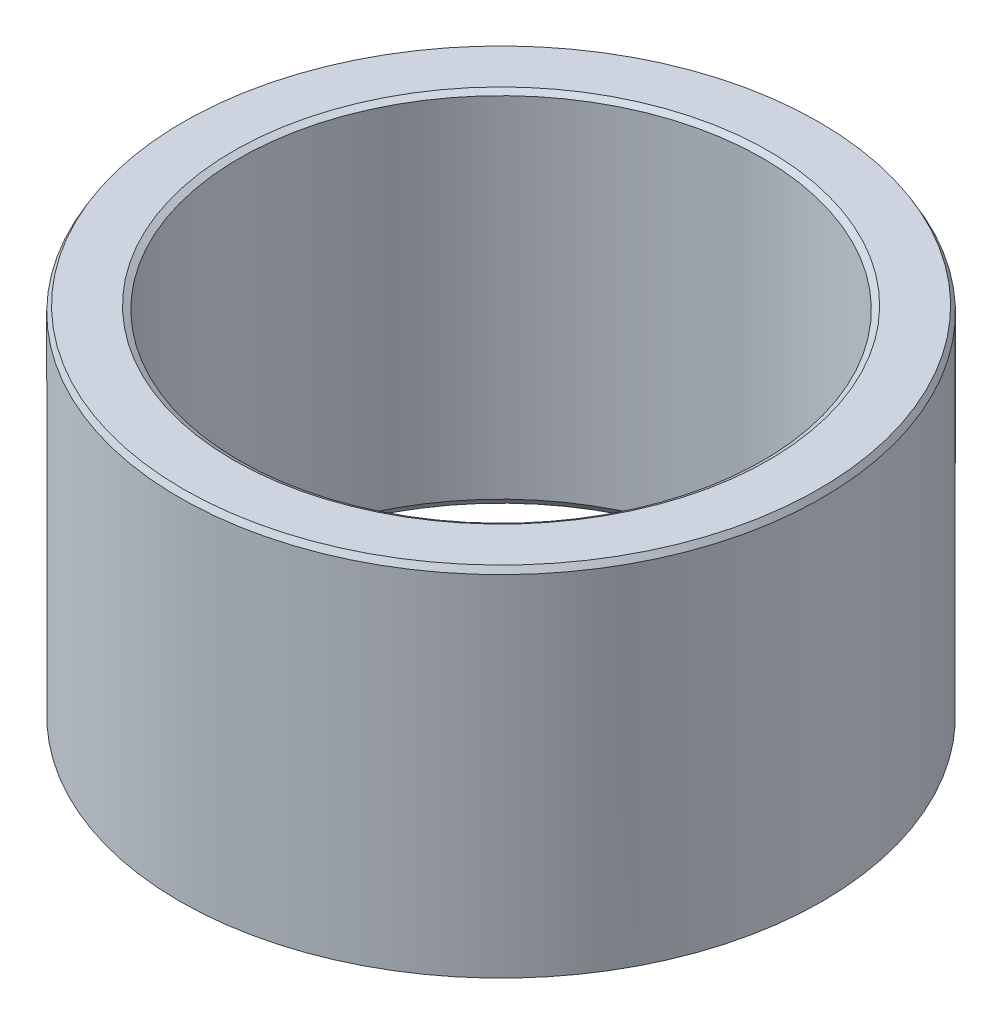
ISO-10303-21;
HEADER;
FILE_DESCRIPTION(('STEP AP214'),'2;1');
FILE_NAME('part.step','',(''),(''),'','','');
FILE_SCHEMA(('AUTOMOTIVE_DESIGN { 1 0 10303 214 1 1 1 1 }'));
ENDSEC;
DATA;
#1=APPLICATION_CONTEXT('core data for automotive mechanical design processes');
#2=APPLICATION_PROTOCOL_DEFINITION('international standard','automotive_design',2000,#1);
#3=PRODUCT_CONTEXT('',#1,'mechanical');
#4=PRODUCT('Part','Part','',(#3));
#5=PRODUCT_RELATED_PRODUCT_CATEGORY('part','',(#4));
#6=PRODUCT_DEFINITION_FORMATION('','',#4);
#7=PRODUCT_DEFINITION_CONTEXT('part definition',#1,'design');
#8=PRODUCT_DEFINITION('design','',#6,#7);
#9=PRODUCT_DEFINITION_SHAPE('','',#8);
#10=(LENGTH_UNIT() NAMED_UNIT(*) SI_UNIT(.MILLI.,.METRE.));
#11=(NAMED_UNIT(*) PLANE_ANGLE_UNIT() SI_UNIT($,.RADIAN.));
#12=(NAMED_UNIT(*) SI_UNIT($,.STERADIAN.) SOLID_ANGLE_UNIT());
#13=UNCERTAINTY_MEASURE_WITH_UNIT(LENGTH_MEASURE(1.E-05),#10,'distance_accuracy_value','');
#14=(GEOMETRIC_REPRESENTATION_CONTEXT(3) GLOBAL_UNCERTAINTY_ASSIGNED_CONTEXT((#13)) GLOBAL_UNIT_ASSIGNED_CONTEXT((#10,
#11,#12)) REPRESENTATION_CONTEXT('',''));
#15=CARTESIAN_POINT('',(0.,0.,0.));
#16=DIRECTION('',(0.,0.,1.));
#17=DIRECTION('',(1.,0.,0.));
#18=AXIS2_PLACEMENT_3D('',#15,#16,#17);
#19=CARTESIAN_POINT('',(0.,58.6155407004771,0.));
#20=DIRECTION('',(0.,-1.,0.));
#21=DIRECTION('',(0.,0.,-1.));
#22=AXIS2_PLACEMENT_3D('',#19,#20,#21);
#23=CYLINDRICAL_SURFACE('',#22,52.5);
#24=CARTESIAN_POINT('',(0.,0.554567945143448,0.));
#25=DIRECTION('',(0.,1.,0.));
#26=DIRECTION('',(0.,0.,1.));
#27=AXIS2_PLACEMENT_3D('',#24,#25,#26);
#28=CIRCLE('',#27,52.5);
#29=CARTESIAN_POINT('',(0.,0.554567945143448,52.5));
#30=VERTEX_POINT('',#29);
#31=EDGE_CURVE('E10',#30,#30,#28,.T.);
#32=ORIENTED_EDGE('',*,*,#31,.T.);
#33=EDGE_LOOP('',(#32));
#34=FACE_BOUND('',#33,.T.);
#35=CARTESIAN_POINT('',(0.,57.6550008432396,0.));
#36=DIRECTION('',(0.,1.,0.));
#37=DIRECTION('',(0.,0.,1.));
#38=AXIS2_PLACEMENT_3D('',#35,#36,#37);
#39=CIRCLE('',#38,52.5);
#40=CARTESIAN_POINT('',(0.,57.6550008432396,-52.5));
#41=VERTEX_POINT('',#40);
#42=EDGE_CURVE('E50',#41,#41,#39,.F.);
#43=ORIENTED_EDGE('',*,*,#42,.T.);
#44=EDGE_LOOP('',(#43));
#45=FACE_BOUND('',#44,.T.);
#46=ADVANCED_FACE('F39',(#34,#45),#23,.T.);
#47=CARTESIAN_POINT('',(0.,58.6155407004771,0.));
#48=DIRECTION('',(0.,1.,0.));
#49=DIRECTION('',(0.,0.,1.));
#50=AXIS2_PLACEMENT_3D('',#47,#48,#49);
#51=PLANE('',#50);
#52=CARTESIAN_POINT('',(0.,58.6155407004771,0.));
#53=DIRECTION('',(0.,1.,0.));
#54=DIRECTION('',(0.,0.,1.));
#55=AXIS2_PLACEMENT_3D('',#52,#53,#54);
#56=CIRCLE('',#55,43.7443498539018);
#57=CARTESIAN_POINT('',(0.,58.6155407004771,43.7443498539018));
#58=VERTEX_POINT('',#57);
#59=EDGE_CURVE('E58',#58,#58,#56,.F.);
#60=ORIENTED_EDGE('',*,*,#59,.T.);
#61=EDGE_LOOP('',(#60));
#62=FACE_BOUND('',#61,.T.);
#63=CARTESIAN_POINT('',(0.,58.6155407004771,0.));
#64=DIRECTION('',(0.,1.,0.));
#65=DIRECTION('',(0.,0.,1.));
#66=AXIS2_PLACEMENT_3D('',#63,#64,#65);
#67=CIRCLE('',#66,51.9454320548565);
#68=CARTESIAN_POINT('',(0.,58.6155407004771,-51.9454320548565));
#69=VERTEX_POINT('',#68);
#70=EDGE_CURVE('E61',#69,#69,#67,.T.);
#71=ORIENTED_EDGE('',*,*,#70,.T.);
#72=EDGE_LOOP('',(#71));
#73=FACE_BOUND('',#72,.T.);
#74=ADVANCED_FACE('F88',(#62,#73),#51,.T.);
#75=CARTESIAN_POINT('',(0.,0.,0.));
#76=DIRECTION('',(0.,1.,0.));
#77=DIRECTION('',(0.,0.,1.));
#78=AXIS2_PLACEMENT_3D('',#75,#76,#77);
#79=PLANE('',#78);
#80=CARTESIAN_POINT('',(0.,0.,0.));
#81=DIRECTION('',(0.,1.,0.));
#82=DIRECTION('',(0.,0.,1.));
#83=AXIS2_PLACEMENT_3D('',#80,#81,#82);
#84=CIRCLE('',#83,43.3383779418077);
#85=CARTESIAN_POINT('',(0.,0.,43.3383779418077));
#86=VERTEX_POINT('',#85);
#87=EDGE_CURVE('E51',#86,#86,#84,.T.);
#88=ORIENTED_EDGE('',*,*,#87,.T.);
#89=EDGE_LOOP('',(#88));
#90=FACE_BOUND('',#89,.T.);
#91=CARTESIAN_POINT('',(0.,0.,0.));
#92=DIRECTION('',(0.,1.,0.));
#93=DIRECTION('',(0.,0.,1.));
#94=AXIS2_PLACEMENT_3D('',#91,#92,#93);
#95=CIRCLE('',#94,51.5394601427625);
#96=CARTESIAN_POINT('',(0.,0.,51.5394601427625));
#97=VERTEX_POINT('',#96);
#98=EDGE_CURVE('E54',#97,#97,#95,.F.);
#99=ORIENTED_EDGE('',*,*,#98,.T.);
#100=EDGE_LOOP('',(#99));
#101=FACE_BOUND('',#100,.T.);
#102=ADVANCED_FACE('F83',(#90,#101),#79,.F.);
#103=CARTESIAN_POINT('',(0.,58.6155407004771,0.));
#104=DIRECTION('',(0.,-1.,0.));
#105=DIRECTION('',(0.,0.,-1.));
#106=AXIS2_PLACEMENT_3D('',#103,#104,#105);
#107=CYLINDRICAL_SURFACE('',#106,42.7838099966642);
#108=CARTESIAN_POINT('',(0.,58.0609727553336,0.));
#109=DIRECTION('',(0.,1.,0.));
#110=DIRECTION('',(0.,0.,1.));
#111=AXIS2_PLACEMENT_3D('',#108,#109,#110);
#112=CIRCLE('',#111,42.7838099966642);
#113=CARTESIAN_POINT('',(0.,58.0609727553336,42.7838099966642));
#114=VERTEX_POINT('',#113);
#115=EDGE_CURVE('E67',#114,#114,#112,.T.);
#116=ORIENTED_EDGE('',*,*,#115,.T.);
#117=EDGE_LOOP('',(#116));
#118=FACE_BOUND('',#117,.T.);
#119=CARTESIAN_POINT('',(0.,0.960539857237527,0.));
#120=DIRECTION('',(0.,1.,0.));
#121=DIRECTION('',(0.,0.,1.));
#122=AXIS2_PLACEMENT_3D('',#119,#120,#121);
#123=CIRCLE('',#122,42.7838099966642);
#124=CARTESIAN_POINT('',(0.,0.960539857237527,42.7838099966642));
#125=VERTEX_POINT('',#124);
#126=EDGE_CURVE('E69',#125,#125,#123,.F.);
#127=ORIENTED_EDGE('',*,*,#126,.T.);
#128=EDGE_LOOP('',(#127));
#129=FACE_BOUND('',#128,.T.);
#130=ADVANCED_FACE('F71',(#118,#129),#107,.F.);
#131=CARTESIAN_POINT('',(0.,58.0609727553336,0.));
#132=DIRECTION('',(0.,1.,0.));
#133=DIRECTION('',(0.,0.,1.));
#134=AXIS2_PLACEMENT_3D('',#131,#132,#133);
#135=CONICAL_SURFACE('',#134,42.7838099966642,1.04719755119659);
#136=ORIENTED_EDGE('',*,*,#59,.F.);
#137=EDGE_LOOP('',(#136));
#138=FACE_BOUND('',#137,.T.);
#139=ORIENTED_EDGE('',*,*,#115,.F.);
#140=EDGE_LOOP('',(#139));
#141=FACE_BOUND('',#140,.T.);
#142=ADVANCED_FACE('F77',(#138,#141),#135,.F.);
#143=CARTESIAN_POINT('',(0.,0.,0.));
#144=DIRECTION('',(0.,-1.,0.));
#145=DIRECTION('',(0.,0.,-1.));
#146=AXIS2_PLACEMENT_3D('',#143,#144,#145);
#147=CONICAL_SURFACE('',#146,43.3383779418077,0.523598775598297);
#148=ORIENTED_EDGE('',*,*,#126,.F.);
#149=EDGE_LOOP('',(#148));
#150=FACE_BOUND('',#149,.T.);
#151=ORIENTED_EDGE('',*,*,#87,.F.);
#152=EDGE_LOOP('',(#151));
#153=FACE_BOUND('',#152,.T.);
#154=ADVANCED_FACE('F73',(#150,#153),#147,.F.);
#155=CARTESIAN_POINT('',(0.,0.554567945143448,0.));
#156=DIRECTION('',(0.,1.,0.));
#157=DIRECTION('',(0.,0.,1.));
#158=AXIS2_PLACEMENT_3D('',#155,#156,#157);
#159=CONICAL_SURFACE('',#158,52.5,1.0471975511966);
#160=ORIENTED_EDGE('',*,*,#98,.F.);
#161=EDGE_LOOP('',(#160));
#162=FACE_BOUND('',#161,.T.);
#163=ORIENTED_EDGE('',*,*,#31,.F.);
#164=EDGE_LOOP('',(#163));
#165=FACE_BOUND('',#164,.T.);
#166=ADVANCED_FACE('F76',(#162,#165),#159,.T.);
#167=CARTESIAN_POINT('',(0.,58.6155407004771,0.));
#168=DIRECTION('',(0.,-1.,0.));
#169=DIRECTION('',(0.,0.,-1.));
#170=AXIS2_PLACEMENT_3D('',#167,#168,#169);
#171=CONICAL_SURFACE('',#170,51.9454320548565,0.5235987755983);
#172=CARTESIAN_POINT('',(0.,57.6550008432396,-52.5));
#173=CARTESIAN_POINT('',(0.,57.6650064667524,-52.4942232505714));
#174=CARTESIAN_POINT('',(0.,57.6750120902653,-52.4884465011428));
#175=CARTESIAN_POINT('',(0.,57.6950233372911,-52.4768930022857));
#176=CARTESIAN_POINT('',(0.,57.705028960804,-52.4711162528571));
#177=CARTESIAN_POINT('',(0.,57.7250402078298,-52.459562754));
#178=CARTESIAN_POINT('',(0.,57.7350458313427,-52.4537860045714));
#179=CARTESIAN_POINT('',(0.,57.7550570783685,-52.4422325057142));
#180=CARTESIAN_POINT('',(0.,57.7650627018814,-52.4364557562856));
#181=CARTESIAN_POINT('',(0.,57.7850739489071,-52.4249022574285));
#182=CARTESIAN_POINT('',(0.,57.79507957242,-52.4191255079999));
#183=CARTESIAN_POINT('',(0.,57.8150908194458,-52.4075720091428));
#184=CARTESIAN_POINT('',(0.,57.8250964429587,-52.4017952597142));
#185=CARTESIAN_POINT('',(0.,57.8451076899845,-52.390241760857));
#186=CARTESIAN_POINT('',(0.,57.8551133134974,-52.3844650114284));
#187=CARTESIAN_POINT('',(0.,57.8751245605232,-52.3729115125713));
#188=CARTESIAN_POINT('',(0.,57.8851301840361,-52.3671347631427));
#189=CARTESIAN_POINT('',(0.,57.9051414310618,-52.3555812642855));
#190=CARTESIAN_POINT('',(0.,57.9151470545747,-52.349804514857));
#191=CARTESIAN_POINT('',(0.,57.9351583016005,-52.3382510159998));
#192=CARTESIAN_POINT('',(0.,57.9451639251134,-52.3324742665712));
#193=CARTESIAN_POINT('',(0.,57.9651751721392,-52.3209207677141));
#194=CARTESIAN_POINT('',(0.,57.9751807956521,-52.3151440182855));
#195=CARTESIAN_POINT('',(0.,57.9951920426779,-52.3035905194284));
#196=CARTESIAN_POINT('',(0.,58.0051976661908,-52.2978137699998));
#197=CARTESIAN_POINT('',(0.,58.0252089132165,-52.2862602711426));
#198=CARTESIAN_POINT('',(0.,58.0352145367294,-52.280483521714));
#199=CARTESIAN_POINT('',(0.,58.0552257837552,-52.2689300228569));
#200=CARTESIAN_POINT('',(0.,58.0652314072681,-52.2631532734283));
#201=CARTESIAN_POINT('',(0.,58.0852426542939,-52.2515997745712));
#202=CARTESIAN_POINT('',(0.,58.0952482778068,-52.2458230251426));
#203=CARTESIAN_POINT('',(0.,58.1152595248326,-52.2342695262854));
#204=CARTESIAN_POINT('',(0.,58.1252651483454,-52.2284927768568));
#205=CARTESIAN_POINT('',(0.,58.1452763953712,-52.2169392779997));
#206=CARTESIAN_POINT('',(0.,58.1552820188841,-52.2111625285711));
#207=CARTESIAN_POINT('',(0.,58.1752932659099,-52.1996090297139));
#208=CARTESIAN_POINT('',(0.,58.1852988894228,-52.1938322802854));
#209=CARTESIAN_POINT('',(0.,58.2053101364486,-52.1822787814282));
#210=CARTESIAN_POINT('',(0.,58.2153157599615,-52.1765020319996));
#211=CARTESIAN_POINT('',(0.,58.2353270069873,-52.1649485331425));
#212=CARTESIAN_POINT('',(0.,58.2453326305001,-52.1591717837139));
#213=CARTESIAN_POINT('',(0.,58.2653438775259,-52.1476182848568));
#214=CARTESIAN_POINT('',(0.,58.2753495010388,-52.1418415354282));
#215=CARTESIAN_POINT('',(0.,58.2953607480646,-52.130288036571));
#216=CARTESIAN_POINT('',(0.,58.3053663715775,-52.1245112871424));
#217=CARTESIAN_POINT('',(0.,58.3253776186033,-52.1129577882853));
#218=CARTESIAN_POINT('',(0.,58.3353832421162,-52.1071810388567));
#219=CARTESIAN_POINT('',(0.,58.355394489142,-52.0956275399995));
#220=CARTESIAN_POINT('',(0.,58.3654001126548,-52.089850790571));
#221=CARTESIAN_POINT('',(0.,58.3854113596806,-52.0782972917138));
#222=CARTESIAN_POINT('',(0.,58.3954169831935,-52.0725205422852));
#223=CARTESIAN_POINT('',(0.,58.4154282302193,-52.0609670434281));
#224=CARTESIAN_POINT('',(0.,58.4254338537322,-52.0551902939995));
#225=CARTESIAN_POINT('',(0.,58.445445100758,-52.0436367951423));
#226=CARTESIAN_POINT('',(0.,58.4554507242709,-52.0378600457138));
#227=CARTESIAN_POINT('',(0.,58.4754619712966,-52.0263065468566));
#228=CARTESIAN_POINT('',(0.,58.4854675948095,-52.020529797428));
#229=CARTESIAN_POINT('',(0.,58.5054788418353,-52.0089762985709));
#230=CARTESIAN_POINT('',(0.,58.5154844653482,-52.0031995491423));
#231=CARTESIAN_POINT('',(0.,58.535495712374,-51.9916460502852));
#232=CARTESIAN_POINT('',(0.,58.5455013358869,-51.9858693008566));
#233=CARTESIAN_POINT('',(0.,58.5655125829127,-51.9743158019994));
#234=CARTESIAN_POINT('',(0.,58.5755182064256,-51.9685390525708));
#235=CARTESIAN_POINT('',(0.,58.5955294534513,-51.9569855537137));
#236=CARTESIAN_POINT('',(0.,58.6055350769642,-51.9512088042851));
#237=CARTESIAN_POINT('',(0.,58.6155407004771,-51.9454320548565));
#238=B_SPLINE_CURVE_WITH_KNOTS('',3,(#172,#173,#174,#175,#176,#177,#178,#179,#180,#181,#182,
#183,#184,#185,#186,#187,#188,#189,#190,#191,#192,#193,#194,#195,#196,#197,#198,#199,#200,#201,
#202,#203,#204,#205,#206,#207,#208,#209,#210,#211,#212,#213,#214,#215,#216,#217,#218,#219,#220,
#221,#222,#223,#224,#225,#226,#227,#228,#229,#230,#231,#232,#233,#234,#235,#236,#237),
.UNSPECIFIED.,.F.,.F.,(4,2,2,2,2,2,2,2,2,2,2,2,2,2,2,2,2,2,2,2,2,2,2,2,2,2,2,2,2,2,2,2,4),(0.,
0.0346604965714668,0.069320993142937,0.103981489714401,0.138641986285871,0.173302482857342,
0.207962979428802,0.242623476000273,0.277283972571737,0.311944469143207,0.346604965714674,
0.381265462286138,0.415925958857608,0.450586455429079,0.485246952000543,0.51990744857201,
0.554567945143474,0.589228441714944,0.623888938286414,0.658549434857878,0.693209931429345,
0.727870428000815,0.76253092457228,0.79719142114375,0.831851917715216,0.866512414286681,
0.901172910858151,0.935833407429615,0.970493904001085,1.00515440057255,1.03981489714402,
1.07447539371549,1.10913589028696),.UNSPECIFIED.);
#239=EDGE_CURVE('BSEAM45',#41,#69,#238,.T.);
#240=ORIENTED_EDGE('',*,*,#42,.F.);
#241=ORIENTED_EDGE('',*,*,#70,.F.);
#242=ORIENTED_EDGE('',*,*,#239,.T.);
#243=ORIENTED_EDGE('',*,*,#239,.F.);
#244=EDGE_LOOP('',(#240,#242,#241,#243));
#245=FACE_BOUND('',#244,.T.);
#246=ADVANCED_FACE('F45',(#245),#171,.T.);
#247=CLOSED_SHELL('',(#46,#74,#102,#130,#142,#154,#166,#246));
#248=MANIFOLD_SOLID_BREP('B2',#247);
#249=ADVANCED_BREP_SHAPE_REPRESENTATION('',(#18,#248),#14);
#250=SHAPE_DEFINITION_REPRESENTATION(#9,#249);
ENDSEC;
END-ISO-10303-21;
